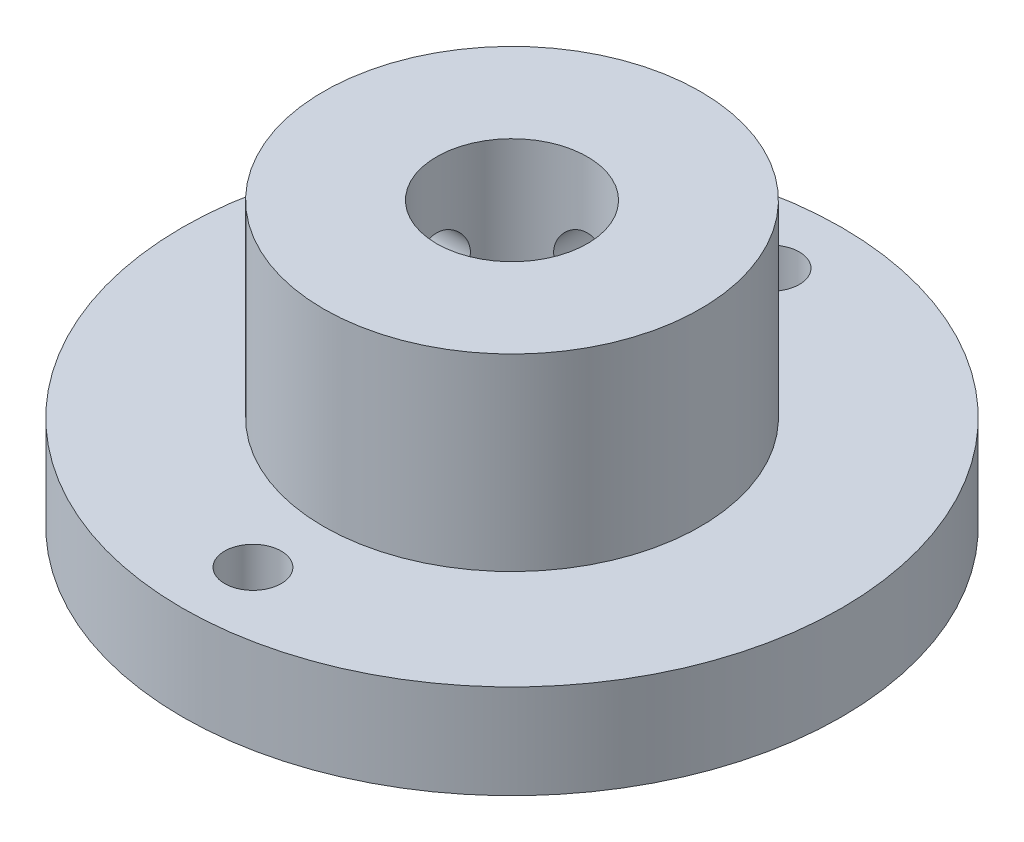
ISO-10303-21;
HEADER;
FILE_DESCRIPTION(('STEP AP214'),'2;1');
FILE_NAME('part.step','',(''),(''),'','','');
FILE_SCHEMA(('AUTOMOTIVE_DESIGN { 1 0 10303 214 1 1 1 1 }'));
ENDSEC;
DATA;
#1=APPLICATION_CONTEXT('core data for automotive mechanical design processes');
#2=APPLICATION_PROTOCOL_DEFINITION('international standard','automotive_design',2000,#1);
#3=PRODUCT_CONTEXT('',#1,'mechanical');
#4=PRODUCT('Part','Part','',(#3));
#5=PRODUCT_RELATED_PRODUCT_CATEGORY('part','',(#4));
#6=PRODUCT_DEFINITION_FORMATION('','',#4);
#7=PRODUCT_DEFINITION_CONTEXT('part definition',#1,'design');
#8=PRODUCT_DEFINITION('design','',#6,#7);
#9=PRODUCT_DEFINITION_SHAPE('','',#8);
#10=(LENGTH_UNIT() NAMED_UNIT(*) SI_UNIT(.MILLI.,.METRE.));
#11=(NAMED_UNIT(*) PLANE_ANGLE_UNIT() SI_UNIT($,.RADIAN.));
#12=(NAMED_UNIT(*) SI_UNIT($,.STERADIAN.) SOLID_ANGLE_UNIT());
#13=UNCERTAINTY_MEASURE_WITH_UNIT(LENGTH_MEASURE(1.E-05),#10,'distance_accuracy_value','');
#14=(GEOMETRIC_REPRESENTATION_CONTEXT(3) GLOBAL_UNCERTAINTY_ASSIGNED_CONTEXT((#13)) GLOBAL_UNIT_ASSIGNED_CONTEXT((#10,
#11,#12)) REPRESENTATION_CONTEXT('',''));
#15=CARTESIAN_POINT('',(0.,0.,0.));
#16=DIRECTION('',(0.,0.,1.));
#17=DIRECTION('',(1.,0.,0.));
#18=AXIS2_PLACEMENT_3D('',#15,#16,#17);
#19=CARTESIAN_POINT('',(0.,5.,0.));
#20=DIRECTION('',(0.,-1.,0.));
#21=DIRECTION('',(0.,0.,-1.));
#22=AXIS2_PLACEMENT_3D('',#19,#20,#21);
#23=CYLINDRICAL_SURFACE('',#22,17.5);
#24=CARTESIAN_POINT('',(0.,5.,0.));
#25=DIRECTION('',(0.,1.,0.));
#26=DIRECTION('',(0.,0.,1.));
#27=AXIS2_PLACEMENT_3D('',#24,#25,#26);
#28=CIRCLE('',#27,17.5);
#29=CARTESIAN_POINT('',(0.,5.,17.5));
#30=VERTEX_POINT('',#29);
#31=EDGE_CURVE('E49',#30,#30,#28,.T.);
#32=ORIENTED_EDGE('',*,*,#31,.F.);
#33=EDGE_LOOP('',(#32));
#34=FACE_BOUND('',#33,.T.);
#35=CARTESIAN_POINT('',(0.,0.,0.));
#36=DIRECTION('',(0.,1.,0.));
#37=DIRECTION('',(0.,0.,1.));
#38=AXIS2_PLACEMENT_3D('',#35,#36,#37);
#39=CIRCLE('',#38,17.5);
#40=CARTESIAN_POINT('',(0.,0.,17.5));
#41=VERTEX_POINT('',#40);
#42=EDGE_CURVE('E54',#41,#41,#39,.T.);
#43=ORIENTED_EDGE('',*,*,#42,.T.);
#44=EDGE_LOOP('',(#43));
#45=FACE_BOUND('',#44,.T.);
#46=ADVANCED_FACE('F37',(#34,#45),#23,.T.);
#47=CARTESIAN_POINT('',(0.,5.,0.));
#48=DIRECTION('',(0.,1.,0.));
#49=DIRECTION('',(0.,0.,1.));
#50=AXIS2_PLACEMENT_3D('',#47,#48,#49);
#51=PLANE('',#50);
#52=CARTESIAN_POINT('',(0.,5.,-13.75));
#53=DIRECTION('',(0.,1.,0.));
#54=DIRECTION('',(0.,0.,1.));
#55=AXIS2_PLACEMENT_3D('',#52,#53,#54);
#56=CIRCLE('',#55,1.5);
#57=CARTESIAN_POINT('',(0.,5.,-12.25));
#58=VERTEX_POINT('',#57);
#59=EDGE_CURVE('E66',#58,#58,#56,.T.);
#60=ORIENTED_EDGE('',*,*,#59,.F.);
#61=EDGE_LOOP('',(#60));
#62=FACE_BOUND('',#61,.T.);
#63=CARTESIAN_POINT('',(0.,5.,13.75));
#64=DIRECTION('',(0.,1.,0.));
#65=DIRECTION('',(0.,0.,1.));
#66=AXIS2_PLACEMENT_3D('',#63,#64,#65);
#67=CIRCLE('',#66,1.5);
#68=CARTESIAN_POINT('',(0.,5.,15.25));
#69=VERTEX_POINT('',#68);
#70=EDGE_CURVE('E98',#69,#69,#67,.T.);
#71=ORIENTED_EDGE('',*,*,#70,.F.);
#72=EDGE_LOOP('',(#71));
#73=FACE_BOUND('',#72,.T.);
#74=CARTESIAN_POINT('',(0.,5.,0.));
#75=DIRECTION('',(0.,1.,0.));
#76=DIRECTION('',(0.,0.,1.));
#77=AXIS2_PLACEMENT_3D('',#74,#75,#76);
#78=CIRCLE('',#77,10.);
#79=CARTESIAN_POINT('',(0.,5.,10.));
#80=VERTEX_POINT('',#79);
#81=EDGE_CURVE('E10',#80,#80,#78,.T.);
#82=ORIENTED_EDGE('',*,*,#81,.F.);
#83=EDGE_LOOP('',(#82));
#84=FACE_BOUND('',#83,.T.);
#85=ORIENTED_EDGE('',*,*,#31,.T.);
#86=EDGE_LOOP('',(#85));
#87=FACE_BOUND('',#86,.T.);
#88=ADVANCED_FACE('F110',(#62,#73,#84,#87),#51,.T.);
#89=CARTESIAN_POINT('',(0.,0.,0.));
#90=DIRECTION('',(0.,1.,0.));
#91=DIRECTION('',(0.,0.,1.));
#92=AXIS2_PLACEMENT_3D('',#89,#90,#91);
#93=PLANE('',#92);
#94=CARTESIAN_POINT('',(0.,0.,-13.75));
#95=DIRECTION('',(0.,1.,0.));
#96=DIRECTION('',(0.,0.,1.));
#97=AXIS2_PLACEMENT_3D('',#94,#95,#96);
#98=CIRCLE('',#97,1.5);
#99=CARTESIAN_POINT('',(0.,0.,-12.25));
#100=VERTEX_POINT('',#99);
#101=EDGE_CURVE('E65',#100,#100,#98,.T.);
#102=ORIENTED_EDGE('',*,*,#101,.T.);
#103=EDGE_LOOP('',(#102));
#104=FACE_BOUND('',#103,.T.);
#105=CARTESIAN_POINT('',(0.,0.,13.75));
#106=DIRECTION('',(0.,1.,0.));
#107=DIRECTION('',(0.,0.,1.));
#108=AXIS2_PLACEMENT_3D('',#105,#106,#107);
#109=CIRCLE('',#108,1.5);
#110=CARTESIAN_POINT('',(0.,0.,15.25));
#111=VERTEX_POINT('',#110);
#112=EDGE_CURVE('E62',#111,#111,#109,.T.);
#113=ORIENTED_EDGE('',*,*,#112,.T.);
#114=EDGE_LOOP('',(#113));
#115=FACE_BOUND('',#114,.T.);
#116=CARTESIAN_POINT('',(0.,0.,0.));
#117=DIRECTION('',(0.,1.,0.));
#118=DIRECTION('',(0.,0.,1.));
#119=AXIS2_PLACEMENT_3D('',#116,#117,#118);
#120=CIRCLE('',#119,4.);
#121=CARTESIAN_POINT('',(0.,0.,4.));
#122=VERTEX_POINT('',#121);
#123=EDGE_CURVE('E201',#122,#122,#120,.T.);
#124=ORIENTED_EDGE('',*,*,#123,.T.);
#125=EDGE_LOOP('',(#124));
#126=FACE_BOUND('',#125,.T.);
#127=ORIENTED_EDGE('',*,*,#42,.F.);
#128=EDGE_LOOP('',(#127));
#129=FACE_BOUND('',#128,.T.);
#130=ADVANCED_FACE('F108',(#104,#115,#126,#129),#93,.F.);
#131=CARTESIAN_POINT('',(0.,15.,0.));
#132=DIRECTION('',(0.,-1.,0.));
#133=DIRECTION('',(0.,0.,-1.));
#134=AXIS2_PLACEMENT_3D('',#131,#132,#133);
#135=CYLINDRICAL_SURFACE('',#134,10.);
#136=CARTESIAN_POINT('',(-9.88685996664259,10.,-1.5));
#137=CARTESIAN_POINT('',(-9.88686136668593,10.08374556929,-1.49999654107284));
#138=CARTESIAN_POINT('',(-9.88793551739101,10.1675397507507,-1.49296296388491));
#139=CARTESIAN_POINT('',(-9.8921131480324,10.3327853148831,-1.46502196657001));
#140=CARTESIAN_POINT('',(-9.8952186073143,10.41423433148,-1.44410101402628));
#141=CARTESIAN_POINT('',(-9.90309938986228,10.5723737554469,-1.38902526098084));
#142=CARTESIAN_POINT('',(-9.90787343131536,10.6490677625422,-1.35488061681397));
#143=CARTESIAN_POINT('',(-9.91855194113145,10.7956270307721,-1.27435063087791));
#144=CARTESIAN_POINT('',(-9.92445625383668,10.8654932302143,-1.22796697429872));
#145=CARTESIAN_POINT('',(-9.9367828924804,10.9969838167543,-1.12387902418558));
#146=CARTESIAN_POINT('',(-9.94320862458057,11.0585456134067,-1.0660960558482));
#147=CARTESIAN_POINT('',(-9.95582368169047,11.1711374856555,-0.941019605444374));
#148=CARTESIAN_POINT('',(-9.96201299368615,11.222166982167,-0.873725600786529));
#149=CARTESIAN_POINT('',(-9.97349347428185,11.3124766316914,-0.731136358052745));
#150=CARTESIAN_POINT('',(-9.97878018435569,11.3516991503225,-0.655804227365767));
#151=CARTESIAN_POINT('',(-9.98782206746405,11.4169115988082,-0.499528850106975));
#152=CARTESIAN_POINT('',(-9.99157732141945,11.4429022278429,-0.418585900270677));
#153=CARTESIAN_POINT('',(-9.99710914797782,11.4807233885308,-0.254031123090569));
#154=CARTESIAN_POINT('',(-9.99890035887344,11.4926587263872,-0.170443884389867));
#155=CARTESIAN_POINT('',(-10.0003524476958,11.5023559348249,-0.00243520401947923));
#156=CARTESIAN_POINT('',(-10.0000134440494,11.5001185933197,0.0819861910157461));
#157=CARTESIAN_POINT('',(-9.99725499660796,11.4816166622376,0.248551718200519));
#158=CARTESIAN_POINT('',(-9.99485227652479,11.4654648282085,0.330708691400007));
#159=CARTESIAN_POINT('',(-9.98825500227851,11.4197693936774,0.491132829143137));
#160=CARTESIAN_POINT('',(-9.98406040199739,11.3902254484986,0.569399893513481));
#161=CARTESIAN_POINT('',(-9.97432193873206,11.3184690030829,0.720163780770317));
#162=CARTESIAN_POINT('',(-9.96877303515638,11.2762090348913,0.792637672323596));
#163=CARTESIAN_POINT('',(-9.95694438245421,11.18025480633,0.929507907150178));
#164=CARTESIAN_POINT('',(-9.95066458523184,11.1265597932931,0.993903718271735));
#165=CARTESIAN_POINT('',(-9.93800158192627,11.0086315511734,1.11345448272265));
#166=CARTESIAN_POINT('',(-9.93161796623257,10.9442998780299,1.16851232950947));
#167=CARTESIAN_POINT('',(-9.91952704453523,10.8072589228763,1.26706599338813));
#168=CARTESIAN_POINT('',(-9.91381974269649,10.7345495892801,1.31056173927999));
#169=CARTESIAN_POINT('',(-9.90372775286855,10.5827160370594,1.38476964534605));
#170=CARTESIAN_POINT('',(-9.89934409845291,10.5035868663376,1.41547182270081));
#171=CARTESIAN_POINT('',(-9.89241402899059,10.3412147448526,1.46312336208879));
#172=CARTESIAN_POINT('',(-9.88986748446299,10.2579720844533,1.48007369337326));
#173=CARTESIAN_POINT('',(-9.88692451395027,10.0905999104225,1.49960720086655));
#174=CARTESIAN_POINT('',(-9.88650748802574,10.0064868117985,1.50232803265052));
#175=CARTESIAN_POINT('',(-9.88781607937153,9.83900580518267,1.49369057019819));
#176=CARTESIAN_POINT('',(-9.88954163015778,9.75563787414924,1.48233271282302));
#177=CARTESIAN_POINT('',(-9.89492202461453,9.59244018203437,1.44597702952766));
#178=CARTESIAN_POINT('',(-9.89856716482858,9.5125947950584,1.42104778527821));
#179=CARTESIAN_POINT('',(-9.90736801825768,9.3582159079514,1.35832831947087));
#180=CARTESIAN_POINT('',(-9.91252380607176,9.28368267037181,1.32053746276389));
#181=CARTESIAN_POINT('',(-9.92381355687063,9.14142673966496,1.23283677995323));
#182=CARTESIAN_POINT('',(-9.92995459279988,9.07375955272019,1.18283784561766));
#183=CARTESIAN_POINT('',(-9.94250159433355,8.94772714012619,1.07226416837201));
#184=CARTESIAN_POINT('',(-9.94890757490292,8.88936244081885,1.0116888274468));
#185=CARTESIAN_POINT('',(-9.96132705217386,8.78309739336642,0.881075619628183));
#186=CARTESIAN_POINT('',(-9.96733683460423,8.73528827175753,0.810963126771957));
#187=CARTESIAN_POINT('',(-9.97822905032016,8.65212709473736,0.66362208026368));
#188=CARTESIAN_POINT('',(-9.98311151444563,8.61677469853498,0.586393721360439));
#189=CARTESIAN_POINT('',(-9.99118269660795,8.55967625751197,0.427297995861147));
#190=CARTESIAN_POINT('',(-9.99437761717899,8.53788033292164,0.345448858754302));
#191=CARTESIAN_POINT('',(-9.99873976656896,8.50835212046253,0.179200815501193));
#192=CARTESIAN_POINT('',(-9.99990712930801,8.50061890375086,0.0948020781305813));
#193=CARTESIAN_POINT('',(-10.0000812905914,8.4994582954506,-0.073264590860818));
#194=CARTESIAN_POINT('',(-9.99910917023796,8.50589131912303,-0.156931570212052));
#195=CARTESIAN_POINT('',(-9.99515610519141,8.53258138842076,-0.321979795323106));
#196=CARTESIAN_POINT('',(-9.99217516692666,8.55283838980856,-0.403361048396512));
#197=CARTESIAN_POINT('',(-9.98453786742463,8.60655187557024,-0.56148937437966));
#198=CARTESIAN_POINT('',(-9.97988273316947,8.63999869513894,-0.638239793148783));
#199=CARTESIAN_POINT('',(-9.96940834495499,8.71912748798315,-0.785061117896603));
#200=CARTESIAN_POINT('',(-9.96358905320338,8.76480985848035,-0.855131806920708));
#201=CARTESIAN_POINT('',(-9.95136510636178,8.86761769882918,-0.987312585191958));
#202=CARTESIAN_POINT('',(-9.94495548425942,8.92484622581635,-1.04934206644638));
#203=CARTESIAN_POINT('',(-9.93231001689001,9.04890507308047,-1.16296808390268));
#204=CARTESIAN_POINT('',(-9.92607421276291,9.11573764382435,-1.21456216798984));
#205=CARTESIAN_POINT('',(-9.91444484029116,9.25754898323254,-1.30611310822974));
#206=CARTESIAN_POINT('',(-9.90905620156985,9.33257141702183,-1.34600294291209));
#207=CARTESIAN_POINT('',(-9.89978909110724,9.4882967767633,-1.41255613872045));
#208=CARTESIAN_POINT('',(-9.89590905307931,9.56899370785783,-1.43923322574897));
#209=CARTESIAN_POINT('',(-9.89099485524825,9.70837743625648,-1.47254951890026));
#210=CARTESIAN_POINT('',(-9.88945249382379,9.76620339692428,-1.4828276978042));
#211=CARTESIAN_POINT('',(-9.88738456567011,9.88267829173435,-1.49655410576574));
#212=CARTESIAN_POINT('',(-9.88685898576155,9.94132721519962,-1.50000242335076));
#213=CARTESIAN_POINT('',(-9.88685996664259,10.,-1.5));
#214=B_SPLINE_CURVE_WITH_KNOTS('',3,(#136,#137,#138,#139,#140,#141,#142,#143,#144,#145,#146,
#147,#148,#149,#150,#151,#152,#153,#154,#155,#156,#157,#158,#159,#160,#161,#162,#163,#164,#165,
#166,#167,#168,#169,#170,#171,#172,#173,#174,#175,#176,#177,#178,#179,#180,#181,#182,#183,#184,
#185,#186,#187,#188,#189,#190,#191,#192,#193,#194,#195,#196,#197,#198,#199,#200,#201,#202,#203,
#204,#205,#206,#207,#208,#209,#210,#211,#212,#213),.UNSPECIFIED.,.T.,.F.,(4,2,2,2,2,2,2,2,2,2,2,
2,2,2,2,2,2,2,2,2,2,2,2,2,2,2,2,2,2,2,2,2,2,2,2,2,2,2,4),(0.,0.251022251804867,
0.502289469561802,0.753364085335674,1.00440414866132,1.25724158649107,1.51009292207817,
1.76415922105782,2.018212093645,2.27035832534397,2.52249053939374,2.77259862515728,
3.02271314839401,3.27377316386453,3.52484970949272,3.77839544666269,4.0319427451435,
4.28568751773138,4.53941440444341,4.79068214603743,5.04194209099918,5.29194394807374,
5.54195815286117,5.79385486001302,6.04576581461801,6.29977537753516,6.55377799071854,
6.8068404089109,7.05988611170473,7.31044963622326,7.56101235892822,7.81139182257833,
8.06177941567106,8.31450950010969,8.56729890236862,8.82150878824931,9.07545403445563,
9.25132441891613,9.42719252376192),.UNSPECIFIED.);
#215=CARTESIAN_POINT('',(-9.88685996664259,10.,-1.5));
#216=VERTEX_POINT('',#215);
#217=EDGE_CURVE('E76',#216,#216,#214,.T.);
#218=ORIENTED_EDGE('',*,*,#217,.T.);
#219=EDGE_LOOP('',(#218));
#220=FACE_BOUND('',#219,.T.);
#221=CARTESIAN_POINT('',(0.,11.5,-10.));
#222=CARTESIAN_POINT('',(-0.0837515444816422,11.4999965461848,-9.99999865771297));
#223=CARTESIAN_POINT('',(-0.167551685082132,11.4929619991594,-9.9989368253704));
#224=CARTESIAN_POINT('',(-0.332809627994913,11.4650168000173,-9.99480315973187));
#225=CARTESIAN_POINT('',(-0.414265068974229,11.4440926370551,-9.99172936938473));
#226=CARTESIAN_POINT('',(-0.57241808622186,11.3890074950324,-9.98391721219526));
#227=CARTESIAN_POINT('',(-0.649119207826798,11.3548565204941,-9.97918010370919));
#228=CARTESIAN_POINT('',(-0.795690428635254,11.2743116205831,-9.96856475911724));
#229=CARTESIAN_POINT('',(-0.865561474725188,11.2279193955826,-9.96268668152773));
#230=CARTESIAN_POINT('',(-0.997046719562126,11.1238227350601,-9.95039170991452));
#231=CARTESIAN_POINT('',(-1.0585998322255,11.0660415437918,-9.94397133890331));
#232=CARTESIAN_POINT('',(-1.17117490668948,10.9409723111061,-9.93134261133238));
#233=CARTESIAN_POINT('',(-1.22219626272936,10.8736837232215,-9.92513426698505));
#234=CARTESIAN_POINT('',(-1.31249729499943,10.7310993564775,-9.91359877458726));
#235=CARTESIAN_POINT('',(-1.35171787037205,10.6557657530187,-9.90827611975031));
#236=CARTESIAN_POINT('',(-1.41692632171056,10.4994871793546,-9.89916211306268));
#237=CARTESIAN_POINT('',(-1.44291491889163,10.4185425152561,-9.89537067775449));
#238=CARTESIAN_POINT('',(-1.48073198798911,10.2539819581283,-9.88978256218673));
#239=CARTESIAN_POINT('',(-1.49266503640518,10.170390606592,-9.8879711574125));
#240=CARTESIAN_POINT('',(-1.50235624033932,10.0023738340127,-9.88650348970582));
#241=CARTESIAN_POINT('',(-1.50011520973796,9.91794846113751,-9.88684710303147));
#242=CARTESIAN_POINT('',(-1.48160733250787,9.75139891980586,-9.88963718352409));
#243=CARTESIAN_POINT('',(-1.4654569592775,9.6692614735152,-9.89206618761549));
#244=CARTESIAN_POINT('',(-1.41977117403734,9.50887563112847,-9.89872608126367));
#245=CARTESIAN_POINT('',(-1.39023538337812,9.43062734511926,-9.90295702179379));
#246=CARTESIAN_POINT('',(-1.31849603529736,9.27988662871714,-9.91276335545481));
#247=CARTESIAN_POINT('',(-1.27624314283197,9.20741803090761,-9.91834396766526));
#248=CARTESIAN_POINT('',(-1.18030413128954,9.07055540421807,-9.93021707574548));
#249=CARTESIAN_POINT('',(-1.12661726182478,9.00616190573063,-9.93650961832501));
#250=CARTESIAN_POINT('',(-1.00869493078248,8.88660233926029,-9.9491747305621));
#251=CARTESIAN_POINT('',(-0.944359329642,8.83153500971366,-9.95554747112815));
#252=CARTESIAN_POINT('',(-0.807307089894184,8.73296406549274,-9.96759647648462));
#253=CARTESIAN_POINT('',(-0.734590414588167,8.68946050145611,-9.9732727382251));
#254=CARTESIAN_POINT('',(-0.582754598213682,8.61524691350046,-9.98329515585393));
#255=CARTESIAN_POINT('',(-0.503631677836776,8.58454450815971,-9.98764051925428));
#256=CARTESIAN_POINT('',(-0.341273182487057,8.53689061031463,-9.99450490557069));
#257=CARTESIAN_POINT('',(-0.258037885952598,8.51993818818443,-9.99702405195467));
#258=CARTESIAN_POINT('',(-0.0906695676436436,8.50039677018331,-9.99993581133871));
#259=CARTESIAN_POINT('',(-0.00655273187046751,8.49767202862068,-10.0003485209039));
#260=CARTESIAN_POINT('',(0.160936677662286,8.50630300531103,-9.99905561015226));
#261=CARTESIAN_POINT('',(0.24430927438188,8.5176582876681,-9.99735005541369));
#262=CARTESIAN_POINT('',(0.407532387431412,8.55401410017754,-9.99202468615333));
#263=CARTESIAN_POINT('',(0.487397963079842,8.57894849603085,-9.98841415207984));
#264=CARTESIAN_POINT('',(0.641814958643003,8.64168499746176,-9.97968235658369));
#265=CARTESIAN_POINT('',(0.716366128795103,8.67948770733364,-9.97456102421565));
#266=CARTESIAN_POINT('',(0.858634979291924,8.76720622456387,-9.96332682468686));
#267=CARTESIAN_POINT('',(0.926299009891568,8.81720814001278,-9.95720701626745));
#268=CARTESIAN_POINT('',(1.05232367317771,8.92778581162875,-9.94467863012165));
#269=CARTESIAN_POINT('',(1.11068376479341,8.98836218232465,-9.93827003562867));
#270=CARTESIAN_POINT('',(1.21693784957196,9.1189735331765,-9.92582264304494));
#271=CARTESIAN_POINT('',(1.26474084747421,9.18908292519477,-9.91978736017588));
#272=CARTESIAN_POINT('',(1.34789129270584,9.33641604051178,-9.90883219104903));
#273=CARTESIAN_POINT('',(1.38323907656436,9.41363957152147,-9.90391227465628));
#274=CARTESIAN_POINT('',(1.44033467323944,9.57273753362314,-9.89577033008645));
#275=CARTESIAN_POINT('',(1.46213037141636,9.65459446097125,-9.89254233006438));
#276=CARTESIAN_POINT('',(1.49165549501586,9.82085901543511,-9.88813382297802));
#277=CARTESIAN_POINT('',(1.49938589183067,9.90526646599468,-9.88695317451771));
#278=CARTESIAN_POINT('',(1.5005378666944,10.0733290633158,-9.88677832610841));
#279=CARTESIAN_POINT('',(1.49410252167313,10.1569832417569,-9.88776226333502));
#280=CARTESIAN_POINT('',(1.46741229544379,10.3220052633235,-9.89175820611174));
#281=CARTESIAN_POINT('',(1.44715743638627,10.4033731101134,-9.89477020841118));
#282=CARTESIAN_POINT('',(1.39345373518665,10.5614730822343,-9.90247526112297));
#283=CARTESIAN_POINT('',(1.36001489324314,10.6382086704334,-9.90716703716075));
#284=CARTESIAN_POINT('',(1.28090667642309,10.7850036338024,-9.91770454557702));
#285=CARTESIAN_POINT('',(1.23523688741502,10.8550627828036,-9.92355031702724));
#286=CARTESIAN_POINT('',(1.13244337659164,10.9872430579752,-9.93580743364938));
#287=CARTESIAN_POINT('',(1.07521369039806,11.0492813332471,-9.94222367881967));
#288=CARTESIAN_POINT('',(0.951148841082834,11.1629245547878,-9.95485788826636));
#289=CARTESIAN_POINT('',(0.88431144835094,11.2145270725762,-9.96107580610759));
#290=CARTESIAN_POINT('',(0.742495707543721,11.3060876766074,-9.9726518579052));
#291=CARTESIAN_POINT('',(0.667474576764759,11.3459801092148,-9.9780050712882));
#292=CARTESIAN_POINT('',(0.511751870248717,11.412538516758,-9.98720028802959));
#293=CARTESIAN_POINT('',(0.431056277096703,11.4392181900537,-9.99104385565757));
#294=CARTESIAN_POINT('',(0.291665727889328,11.4725413427101,-9.99590939261505));
#295=CARTESIAN_POINT('',(0.233831133495278,11.4828226015388,-9.99743549179557));
#296=CARTESIAN_POINT('',(0.117338971600125,11.4965530977126,-9.99948125947896));
#297=CARTESIAN_POINT('',(0.0586814143344173,11.5000024199525,-10.0000009404877));
#298=CARTESIAN_POINT('',(0.,11.5,-10.));
#299=B_SPLINE_CURVE_WITH_KNOTS('',3,(#221,#222,#223,#224,#225,#226,#227,#228,#229,#230,#231,
#232,#233,#234,#235,#236,#237,#238,#239,#240,#241,#242,#243,#244,#245,#246,#247,#248,#249,#250,
#251,#252,#253,#254,#255,#256,#257,#258,#259,#260,#261,#262,#263,#264,#265,#266,#267,#268,#269,
#270,#271,#272,#273,#274,#275,#276,#277,#278,#279,#280,#281,#282,#283,#284,#285,#286,#287,#288,
#289,#290,#291,#292,#293,#294,#295,#296,#297,#298),.UNSPECIFIED.,.T.,.F.,(4,2,2,2,2,2,2,2,2,2,2,
2,2,2,2,2,2,2,2,2,2,2,2,2,2,2,2,2,2,2,2,2,2,2,2,2,2,2,4),(0.,0.251040205031663,0.50232496292915,
0.753420023583236,1.0044802241976,1.25729416136843,1.5101226357258,1.76419702395375,
2.01825756225506,2.27041564605924,2.52255925098982,2.77261177195746,3.02267136690361,
3.27371383476159,3.52477278308534,3.77834291255408,4.03191415238668,4.28563608984874,
4.53934087193401,4.79062058544255,5.04189251991155,5.29195148965948,5.54202220376273,
5.79391188036907,6.04581620028629,6.29981366584672,6.55380426808832,6.80689223457168,
7.05996272137176,7.31048888261064,7.56101464229564,7.81135073984146,8.06169531466879,
8.31444829965721,8.56726003468733,8.82146323384733,9.07540233261441,9.25129851978808,
9.4271925212329),.UNSPECIFIED.);
#300=CARTESIAN_POINT('',(0.,11.5,-10.));
#301=VERTEX_POINT('',#300);
#302=EDGE_CURVE('E75',#301,#301,#299,.T.);
#303=ORIENTED_EDGE('',*,*,#302,.T.);
#304=EDGE_LOOP('',(#303));
#305=FACE_BOUND('',#304,.T.);
#306=CARTESIAN_POINT('',(0.,15.,0.));
#307=DIRECTION('',(0.,1.,0.));
#308=DIRECTION('',(0.,0.,1.));
#309=AXIS2_PLACEMENT_3D('',#306,#307,#308);
#310=CIRCLE('',#309,10.);
#311=CARTESIAN_POINT('',(0.,15.,10.));
#312=VERTEX_POINT('',#311);
#313=EDGE_CURVE('E57',#312,#312,#310,.T.);
#314=ORIENTED_EDGE('',*,*,#313,.F.);
#315=EDGE_LOOP('',(#314));
#316=FACE_BOUND('',#315,.T.);
#317=ORIENTED_EDGE('',*,*,#81,.T.);
#318=EDGE_LOOP('',(#317));
#319=FACE_BOUND('',#318,.T.);
#320=ADVANCED_FACE('F103',(#220,#305,#316,#319),#135,.T.);
#321=CARTESIAN_POINT('',(0.,15.,0.));
#322=DIRECTION('',(0.,1.,0.));
#323=DIRECTION('',(0.,0.,1.));
#324=AXIS2_PLACEMENT_3D('',#321,#322,#323);
#325=PLANE('',#324);
#326=CARTESIAN_POINT('',(0.,15.,0.));
#327=DIRECTION('',(0.,1.,0.));
#328=DIRECTION('',(0.,0.,1.));
#329=AXIS2_PLACEMENT_3D('',#326,#327,#328);
#330=CIRCLE('',#329,4.);
#331=CARTESIAN_POINT('',(0.,15.,4.));
#332=VERTEX_POINT('',#331);
#333=EDGE_CURVE('E68',#332,#332,#330,.T.);
#334=ORIENTED_EDGE('',*,*,#333,.F.);
#335=EDGE_LOOP('',(#334));
#336=FACE_BOUND('',#335,.T.);
#337=ORIENTED_EDGE('',*,*,#313,.T.);
#338=EDGE_LOOP('',(#337));
#339=FACE_BOUND('',#338,.T.);
#340=ADVANCED_FACE('F107',(#336,#339),#325,.T.);
#341=CARTESIAN_POINT('',(0.,0.,0.));
#342=DIRECTION('',(0.,1.,0.));
#343=DIRECTION('',(0.,0.,1.));
#344=AXIS2_PLACEMENT_3D('',#341,#342,#343);
#345=CYLINDRICAL_SURFACE('',#344,4.);
#346=CARTESIAN_POINT('',(-3.70809924354783,10.,-1.5));
#347=CARTESIAN_POINT('',(-3.70809640633806,9.91899251627921,-1.50000304106109));
#348=CARTESIAN_POINT('',(-3.71078260240986,9.83800507749637,-1.49341597549487));
#349=CARTESIAN_POINT('',(-3.72116159304967,9.6784719170868,-1.46736187895468));
#350=CARTESIAN_POINT('',(-3.72885423767112,9.59992612240499,-1.44789523373263));
#351=CARTESIAN_POINT('',(-3.748254802809,9.44762462838648,-1.39689657610574));
#352=CARTESIAN_POINT('',(-3.7599530956926,9.37385794334892,-1.36539347266348));
#353=CARTESIAN_POINT('',(-3.78603134206598,9.23262810318116,-1.29131856742698));
#354=CARTESIAN_POINT('',(-3.80041210067323,9.16516684971748,-1.24874344095039));
#355=CARTESIAN_POINT('',(-3.83103574665713,9.03510968837719,-1.15146661374162));
#356=CARTESIAN_POINT('',(-3.84733341923603,8.97287147037061,-1.09630381213306));
#357=CARTESIAN_POINT('',(-3.87949750628547,8.85827718532852,-0.976395839778926));
#358=CARTESIAN_POINT('',(-3.89536382814785,8.80592322625815,-0.91164863025668));
#359=CARTESIAN_POINT('',(-3.92552873936553,8.71086048770439,-0.7716946551776));
#360=CARTESIAN_POINT('',(-3.93975561223505,8.66854052528415,-0.696206947538028));
#361=CARTESIAN_POINT('',(-3.96438007973848,8.59734882747509,-0.538555771965247));
#362=CARTESIAN_POINT('',(-3.97477900217006,8.56847242800803,-0.456394630933536));
#363=CARTESIAN_POINT('',(-3.9901869710344,8.52624210422539,-0.291489341676832));
#364=CARTESIAN_POINT('',(-3.99540915214774,8.51227237255955,-0.208923197281597));
#365=CARTESIAN_POINT('',(-4.0006401410794,8.49827879905502,-0.0424643637947864));
#366=CARTESIAN_POINT('',(-4.00065064414902,8.49825042238129,0.0414278850628325));
#367=CARTESIAN_POINT('',(-3.99559265903894,8.51178176146518,0.203743543064476));
#368=CARTESIAN_POINT('',(-3.99077541996683,8.52466929794882,0.2822321782669));
#369=CARTESIAN_POINT('',(-3.97693274932263,8.56253591522556,0.435839217984391));
#370=CARTESIAN_POINT('',(-3.96790701975578,8.58751585226204,0.510957383430298));
#371=CARTESIAN_POINT('',(-3.94637769167531,8.64917045167585,0.656989017303103));
#372=CARTESIAN_POINT('',(-3.93382539470077,8.68601000526841,0.727825392287308));
#373=CARTESIAN_POINT('',(-3.90651310225279,8.77019209692939,0.862486607957558));
#374=CARTESIAN_POINT('',(-3.8917523951284,8.8175380230176,0.926309176932322));
#375=CARTESIAN_POINT('',(-3.86052529655816,8.92462728628319,1.04909048680093));
#376=CARTESIAN_POINT('',(-3.84400963763883,8.98493391565043,1.10754614526348));
#377=CARTESIAN_POINT('',(-3.81182460645722,9.11459299332156,1.21370395569342));
#378=CARTESIAN_POINT('',(-3.79615544748847,9.18394770658664,1.261403406929));
#379=CARTESIAN_POINT('',(-3.76712703500335,9.33171946746283,1.34565611808152));
#380=CARTESIAN_POINT('',(-3.75382677150277,9.41030349368607,1.38193847851831));
#381=CARTESIAN_POINT('',(-3.73172438629002,9.57309622516758,1.44056464441501));
#382=CARTESIAN_POINT('',(-3.72291976205783,9.6573017715937,1.46291620605595));
#383=CARTESIAN_POINT('',(-3.71139597222848,9.82397596231595,1.49190191709668));
#384=CARTESIAN_POINT('',(-3.70836785241537,9.90628410553614,1.49933521158966));
#385=CARTESIAN_POINT('',(-3.70786539525016,10.0710093567417,1.50057885636272));
#386=CARTESIAN_POINT('',(-3.71038967003987,10.1534264323525,1.49439261093762));
#387=CARTESIAN_POINT('',(-3.72039381629735,10.3119299222877,1.46929733520157));
#388=CARTESIAN_POINT('',(-3.72763276216449,10.3881311357647,1.45100618334225));
#389=CARTESIAN_POINT('',(-3.74596487046362,10.5363479447202,1.40299774640638));
#390=CARTESIAN_POINT('',(-3.75705882250173,10.6083626791681,1.37327812034623));
#391=CARTESIAN_POINT('',(-3.7823624311608,10.7491644380762,1.30200292275278));
#392=CARTESIAN_POINT('',(-3.79667328892065,10.8177292921373,1.26004545177047));
#393=CARTESIAN_POINT('',(-3.82662814294291,10.947128981726,1.16591317862479));
#394=CARTESIAN_POINT('',(-3.84227262594077,11.0079609746246,1.11373463696435));
#395=CARTESIAN_POINT('',(-3.87433046553184,11.1241683731951,0.996727340900938));
#396=CARTESIAN_POINT('',(-3.89072969357028,11.1789534087688,0.931306341491062));
#397=CARTESIAN_POINT('',(-3.92149874963302,11.2768383675894,0.791797471753151));
#398=CARTESIAN_POINT('',(-3.93586857107664,11.3199382529458,0.717709573322674));
#399=CARTESIAN_POINT('',(-3.96094985704552,11.3929460561996,0.563016329468478));
#400=CARTESIAN_POINT('',(-3.9716738133801,11.4228991237926,0.482434433064628));
#401=CARTESIAN_POINT('',(-3.98829436712571,11.4686564138499,0.316881887523256));
#402=CARTESIAN_POINT('',(-3.99419323299412,11.4844672854224,0.231913320723594));
#403=CARTESIAN_POINT('',(-4.00028407317073,11.5007744027548,0.0653355852738167));
#404=CARTESIAN_POINT('',(-4.00078860953764,11.502109483059,-0.016180768060844));
#405=CARTESIAN_POINT('',(-3.99684889809224,11.4915848405546,-0.178226786412423));
#406=CARTESIAN_POINT('',(-3.9924052471313,11.4797267091141,-0.258756569245256));
#407=CARTESIAN_POINT('',(-3.97921089603771,11.4437411485064,-0.414548248377125));
#408=CARTESIAN_POINT('',(-3.97056791378017,11.4199200941216,-0.489890731068833));
#409=CARTESIAN_POINT('',(-3.9498778362099,11.3609899866156,-0.635515473006389));
#410=CARTESIAN_POINT('',(-3.93783009655664,11.3258787966953,-0.705796771275542));
#411=CARTESIAN_POINT('',(-3.91090618300074,11.2436860564952,-0.842540176994412));
#412=CARTESIAN_POINT('',(-3.89593240108828,11.1961633594859,-0.908717548846849));
#413=CARTESIAN_POINT('',(-3.86499507694844,11.0911921698124,-1.03241734752336));
#414=CARTESIAN_POINT('',(-3.84903118274027,11.0337401341921,-1.0899366712559));
#415=CARTESIAN_POINT('',(-3.81688129739175,10.9069358683549,-1.19781214236195));
#416=CARTESIAN_POINT('',(-3.8007280534916,10.8371155978457,-1.24762999816025));
#417=CARTESIAN_POINT('',(-3.77098325003638,10.6895841304267,-1.33484709556843));
#418=CARTESIAN_POINT('',(-3.75739195631216,10.6118721159465,-1.37224504878157));
#419=CARTESIAN_POINT('',(-3.73402269853266,10.4470443190246,-1.4346588697426));
#420=CARTESIAN_POINT('',(-3.7244380329086,10.3596656334882,-1.45906002899523));
#421=CARTESIAN_POINT('',(-3.71147994336315,10.1815147280442,-1.49172356722079));
#422=CARTESIAN_POINT('',(-3.70810242179736,10.09074478729,-1.49999659339571));
#423=CARTESIAN_POINT('',(-3.70809924354783,10.,-1.5));
#424=B_SPLINE_CURVE_WITH_KNOTS('',3,(#346,#347,#348,#349,#350,#351,#352,#353,#354,#355,#356,
#357,#358,#359,#360,#361,#362,#363,#364,#365,#366,#367,#368,#369,#370,#371,#372,#373,#374,#375,
#376,#377,#378,#379,#380,#381,#382,#383,#384,#385,#386,#387,#388,#389,#390,#391,#392,#393,#394,
#395,#396,#397,#398,#399,#400,#401,#402,#403,#404,#405,#406,#407,#408,#409,#410,#411,#412,#413,
#414,#415,#416,#417,#418,#419,#420,#421,#422,#423),.UNSPECIFIED.,.T.,.F.,(4,2,2,2,2,2,2,2,2,2,2,
2,2,2,2,2,2,2,2,2,2,2,2,2,2,2,2,2,2,2,2,2,2,2,2,2,2,2,4),(0.,0.242684541416169,
0.485361814598854,0.72745985675703,0.969630679682932,1.22274652401128,1.47591628822983,
1.73770072136421,1.9993942638133,2.24980018489679,2.50012465404857,2.73806472803194,
2.97602165263335,3.21744131210668,3.45893893628976,3.71456675065874,3.97025867827334,
4.23162592252966,4.49284751635474,4.73965657740485,4.98640395388884,5.22143845928198,
5.45652113429526,5.70041561005821,5.94439948466355,6.20385016993624,6.46330169650177,
6.72185508890168,6.98028685560126,7.22365720549935,7.46699820319479,7.7044027400389,
7.94185223512831,8.18928323676986,8.43680270894964,8.69738599542078,8.95799630544242,
9.23003178870926,9.50188762323053),.UNSPECIFIED.);
#425=CARTESIAN_POINT('',(-3.70809924354783,10.,-1.5));
#426=VERTEX_POINT('',#425);
#427=EDGE_CURVE('E40',#426,#426,#424,.T.);
#428=ORIENTED_EDGE('',*,*,#427,.T.);
#429=EDGE_LOOP('',(#428));
#430=FACE_BOUND('',#429,.T.);
#431=CARTESIAN_POINT('',(1.5,10.,-3.70809924354783));
#432=CARTESIAN_POINT('',(1.50000304106109,9.91899251627921,-3.70809640633806));
#433=CARTESIAN_POINT('',(1.49341597549487,9.83800507749637,-3.71078260240986));
#434=CARTESIAN_POINT('',(1.46736187895468,9.6784719170868,-3.72116159304967));
#435=CARTESIAN_POINT('',(1.44789523373263,9.59992612240499,-3.72885423767112));
#436=CARTESIAN_POINT('',(1.39689657610574,9.44762462838648,-3.748254802809));
#437=CARTESIAN_POINT('',(1.36539347266348,9.37385794334892,-3.7599530956926));
#438=CARTESIAN_POINT('',(1.29131856742698,9.23262810318116,-3.78603134206598));
#439=CARTESIAN_POINT('',(1.24874344095039,9.16516684971748,-3.80041210067323));
#440=CARTESIAN_POINT('',(1.15146661374162,9.03510968837719,-3.83103574665713));
#441=CARTESIAN_POINT('',(1.09630381213306,8.97287147037061,-3.84733341923603));
#442=CARTESIAN_POINT('',(0.976395839778928,8.85827718532852,-3.87949750628547));
#443=CARTESIAN_POINT('',(0.911648630256681,8.80592322625815,-3.89536382814785));
#444=CARTESIAN_POINT('',(0.771694655177601,8.71086048770439,-3.92552873936553));
#445=CARTESIAN_POINT('',(0.696206947538029,8.66854052528415,-3.93975561223505));
#446=CARTESIAN_POINT('',(0.538555771965248,8.59734882747509,-3.96438007973848));
#447=CARTESIAN_POINT('',(0.456394630933537,8.56847242800803,-3.97477900217006));
#448=CARTESIAN_POINT('',(0.291489341676833,8.52624210422539,-3.9901869710344));
#449=CARTESIAN_POINT('',(0.208923197281598,8.51227237255955,-3.99540915214774));
#450=CARTESIAN_POINT('',(0.042464363794787,8.49827879905502,-4.0006401410794));
#451=CARTESIAN_POINT('',(-0.0414278850628321,8.49825042238129,-4.00065064414902));
#452=CARTESIAN_POINT('',(-0.203743543064475,8.51178176146518,-3.99559265903894));
#453=CARTESIAN_POINT('',(-0.282232178266899,8.52466929794882,-3.99077541996683));
#454=CARTESIAN_POINT('',(-0.435839217984391,8.56253591522556,-3.97693274932263));
#455=CARTESIAN_POINT('',(-0.510957383430298,8.58751585226204,-3.96790701975578));
#456=CARTESIAN_POINT('',(-0.656989017303103,8.64917045167585,-3.94637769167531));
#457=CARTESIAN_POINT('',(-0.727825392287308,8.68601000526841,-3.93382539470077));
#458=CARTESIAN_POINT('',(-0.862486607957558,8.77019209692939,-3.90651310225279));
#459=CARTESIAN_POINT('',(-0.926309176932321,8.8175380230176,-3.8917523951284));
#460=CARTESIAN_POINT('',(-1.04909048680093,8.92462728628319,-3.86052529655816));
#461=CARTESIAN_POINT('',(-1.10754614526348,8.98493391565043,-3.84400963763883));
#462=CARTESIAN_POINT('',(-1.21370395569342,9.11459299332156,-3.81182460645722));
#463=CARTESIAN_POINT('',(-1.261403406929,9.18394770658664,-3.79615544748847));
#464=CARTESIAN_POINT('',(-1.34565611808151,9.33171946746283,-3.76712703500335));
#465=CARTESIAN_POINT('',(-1.38193847851831,9.41030349368607,-3.75382677150277));
#466=CARTESIAN_POINT('',(-1.44056464441501,9.57309622516758,-3.73172438629003));
#467=CARTESIAN_POINT('',(-1.46291620605595,9.6573017715937,-3.72291976205783));
#468=CARTESIAN_POINT('',(-1.49190191709668,9.82397596231596,-3.71139597222848));
#469=CARTESIAN_POINT('',(-1.49933521158966,9.90628410553614,-3.70836785241537));
#470=CARTESIAN_POINT('',(-1.50057885636272,10.0710093567417,-3.70786539525016));
#471=CARTESIAN_POINT('',(-1.49439261093762,10.1534264323525,-3.71038967003987));
#472=CARTESIAN_POINT('',(-1.46929733520157,10.3119299222877,-3.72039381629735));
#473=CARTESIAN_POINT('',(-1.45100618334224,10.3881311357647,-3.72763276216449));
#474=CARTESIAN_POINT('',(-1.40299774640637,10.5363479447202,-3.74596487046362));
#475=CARTESIAN_POINT('',(-1.37327812034623,10.6083626791681,-3.75705882250173));
#476=CARTESIAN_POINT('',(-1.30200292275278,10.7491644380762,-3.7823624311608));
#477=CARTESIAN_POINT('',(-1.26004545177047,10.8177292921373,-3.79667328892065));
#478=CARTESIAN_POINT('',(-1.16591317862479,10.947128981726,-3.82662814294291));
#479=CARTESIAN_POINT('',(-1.11373463696434,11.0079609746246,-3.84227262594077));
#480=CARTESIAN_POINT('',(-0.996727340900936,11.1241683731951,-3.87433046553184));
#481=CARTESIAN_POINT('',(-0.93130634149106,11.1789534087688,-3.89072969357028));
#482=CARTESIAN_POINT('',(-0.791797471753149,11.2768383675894,-3.92149874963302));
#483=CARTESIAN_POINT('',(-0.717709573322671,11.3199382529458,-3.93586857107664));
#484=CARTESIAN_POINT('',(-0.563016329468475,11.3929460561996,-3.96094985704552));
#485=CARTESIAN_POINT('',(-0.482434433064625,11.4228991237926,-3.9716738133801));
#486=CARTESIAN_POINT('',(-0.316881887523253,11.4686564138499,-3.98829436712571));
#487=CARTESIAN_POINT('',(-0.231913320723591,11.4844672854224,-3.99419323299413));
#488=CARTESIAN_POINT('',(-0.0653355852738142,11.5007744027548,-4.00028407317073));
#489=CARTESIAN_POINT('',(0.0161807680608466,11.502109483059,-4.00078860953764));
#490=CARTESIAN_POINT('',(0.178226786412425,11.4915848405546,-3.99684889809223));
#491=CARTESIAN_POINT('',(0.258756569245258,11.4797267091141,-3.9924052471313));
#492=CARTESIAN_POINT('',(0.414548248377127,11.4437411485064,-3.97921089603771));
#493=CARTESIAN_POINT('',(0.489890731068836,11.4199200941216,-3.97056791378017));
#494=CARTESIAN_POINT('',(0.635515473006391,11.3609899866156,-3.9498778362099));
#495=CARTESIAN_POINT('',(0.705796771275544,11.3258787966952,-3.93783009655664));
#496=CARTESIAN_POINT('',(0.842540176994414,11.2436860564952,-3.91090618300074));
#497=CARTESIAN_POINT('',(0.90871754884685,11.1961633594859,-3.89593240108828));
#498=CARTESIAN_POINT('',(1.03241734752336,11.0911921698124,-3.86499507694844));
#499=CARTESIAN_POINT('',(1.0899366712559,11.0337401341921,-3.84903118274027));
#500=CARTESIAN_POINT('',(1.19781214236196,10.9069358683549,-3.81688129739175));
#501=CARTESIAN_POINT('',(1.24762999816025,10.8371155978457,-3.8007280534916));
#502=CARTESIAN_POINT('',(1.33484709556843,10.6895841304267,-3.77098325003638));
#503=CARTESIAN_POINT('',(1.37224504878157,10.6118721159465,-3.75739195631216));
#504=CARTESIAN_POINT('',(1.4346588697426,10.4470443190246,-3.73402269853266));
#505=CARTESIAN_POINT('',(1.45906002899523,10.3596656334882,-3.7244380329086));
#506=CARTESIAN_POINT('',(1.49172356722079,10.1815147280442,-3.71147994336315));
#507=CARTESIAN_POINT('',(1.49999659339571,10.09074478729,-3.70810242179736));
#508=CARTESIAN_POINT('',(1.5,10.,-3.70809924354783));
#509=B_SPLINE_CURVE_WITH_KNOTS('',3,(#431,#432,#433,#434,#435,#436,#437,#438,#439,#440,#441,
#442,#443,#444,#445,#446,#447,#448,#449,#450,#451,#452,#453,#454,#455,#456,#457,#458,#459,#460,
#461,#462,#463,#464,#465,#466,#467,#468,#469,#470,#471,#472,#473,#474,#475,#476,#477,#478,#479,
#480,#481,#482,#483,#484,#485,#486,#487,#488,#489,#490,#491,#492,#493,#494,#495,#496,#497,#498,
#499,#500,#501,#502,#503,#504,#505,#506,#507,#508),.UNSPECIFIED.,.T.,.F.,(4,2,2,2,2,2,2,2,2,2,2,
2,2,2,2,2,2,2,2,2,2,2,2,2,2,2,2,2,2,2,2,2,2,2,2,2,2,2,4),(0.,0.242684541416169,
0.485361814598854,0.727459856757031,0.969630679682933,1.22274652401128,1.47591628822983,
1.73770072136421,1.9993942638133,2.24980018489679,2.50012465404857,2.73806472803194,
2.97602165263335,3.21744131210668,3.45893893628976,3.71456675065874,3.97025867827335,
4.23162592252966,4.49284751635474,4.73965657740485,4.98640395388884,5.22143845928199,
5.45652113429526,5.70041561005821,5.94439948466355,6.20385016993624,6.46330169650178,
6.72185508890168,6.98028685560127,7.22365720549936,7.4669982031948,7.7044027400389,
7.94185223512831,8.18928323676987,8.43680270894964,8.69738599542079,8.95799630544242,
9.23003178870926,9.50188762323053),.UNSPECIFIED.);
#510=CARTESIAN_POINT('',(1.5,10.,-3.70809924354783));
#511=VERTEX_POINT('',#510);
#512=EDGE_CURVE('E69',#511,#511,#509,.T.);
#513=ORIENTED_EDGE('',*,*,#512,.T.);
#514=EDGE_LOOP('',(#513));
#515=FACE_BOUND('',#514,.T.);
#516=ORIENTED_EDGE('',*,*,#123,.F.);
#517=EDGE_LOOP('',(#516));
#518=FACE_BOUND('',#517,.T.);
#519=ORIENTED_EDGE('',*,*,#333,.T.);
#520=EDGE_LOOP('',(#519));
#521=FACE_BOUND('',#520,.T.);
#522=ADVANCED_FACE('F77',(#430,#515,#518,#521),#345,.F.);
#523=CARTESIAN_POINT('',(0.,-5.,13.75));
#524=DIRECTION('',(0.,1.,0.));
#525=DIRECTION('',(0.,0.,1.));
#526=AXIS2_PLACEMENT_3D('',#523,#524,#525);
#527=CYLINDRICAL_SURFACE('',#526,1.5);
#528=ORIENTED_EDGE('',*,*,#70,.T.);
#529=EDGE_LOOP('',(#528));
#530=FACE_BOUND('',#529,.T.);
#531=ORIENTED_EDGE('',*,*,#112,.F.);
#532=EDGE_LOOP('',(#531));
#533=FACE_BOUND('',#532,.T.);
#534=ADVANCED_FACE('F146',(#530,#533),#527,.F.);
#535=CARTESIAN_POINT('',(0.,-5.,-13.75));
#536=DIRECTION('',(0.,1.,0.));
#537=DIRECTION('',(0.,0.,1.));
#538=AXIS2_PLACEMENT_3D('',#535,#536,#537);
#539=CYLINDRICAL_SURFACE('',#538,1.5);
#540=ORIENTED_EDGE('',*,*,#59,.T.);
#541=EDGE_LOOP('',(#540));
#542=FACE_BOUND('',#541,.T.);
#543=ORIENTED_EDGE('',*,*,#101,.F.);
#544=EDGE_LOOP('',(#543));
#545=FACE_BOUND('',#544,.T.);
#546=ADVANCED_FACE('F86',(#542,#545),#539,.F.);
#547=CARTESIAN_POINT('',(0.,10.,-17.5));
#548=DIRECTION('',(0.,0.,1.));
#549=DIRECTION('',(1.,0.,0.));
#550=AXIS2_PLACEMENT_3D('',#547,#548,#549);
#551=CYLINDRICAL_SURFACE('',#550,1.5);
#552=ORIENTED_EDGE('',*,*,#512,.F.);
#553=EDGE_LOOP('',(#552));
#554=FACE_BOUND('',#553,.T.);
#555=ORIENTED_EDGE('',*,*,#302,.F.);
#556=EDGE_LOOP('',(#555));
#557=FACE_BOUND('',#556,.T.);
#558=ADVANCED_FACE('F81',(#554,#557),#551,.F.);
#559=CARTESIAN_POINT('',(-17.5,10.,0.));
#560=DIRECTION('',(1.,0.,0.));
#561=DIRECTION('',(0.,0.,-1.));
#562=AXIS2_PLACEMENT_3D('',#559,#560,#561);
#563=CYLINDRICAL_SURFACE('',#562,1.5);
#564=ORIENTED_EDGE('',*,*,#427,.F.);
#565=EDGE_LOOP('',(#564));
#566=FACE_BOUND('',#565,.T.);
#567=ORIENTED_EDGE('',*,*,#217,.F.);
#568=EDGE_LOOP('',(#567));
#569=FACE_BOUND('',#568,.T.);
#570=ADVANCED_FACE('F85',(#566,#569),#563,.F.);
#571=CLOSED_SHELL('',(#46,#88,#130,#320,#340,#522,#534,#546,#558,#570));
#572=MANIFOLD_SOLID_BREP('B2',#571);
#573=ADVANCED_BREP_SHAPE_REPRESENTATION('',(#18,#572),#14);
#574=SHAPE_DEFINITION_REPRESENTATION(#9,#573);
ENDSEC;
END-ISO-10303-21;
